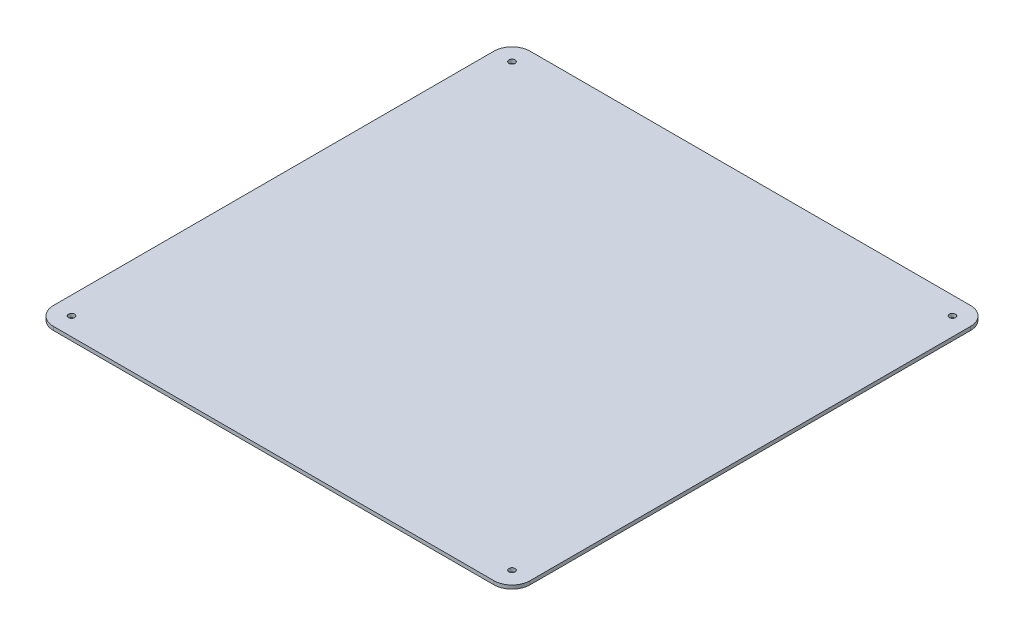
ISO-10303-21;
HEADER;
FILE_DESCRIPTION(('STEP AP214'),'2;1');
FILE_NAME('part.step','',(''),(''),'','','');
FILE_SCHEMA(('AUTOMOTIVE_DESIGN { 1 0 10303 214 1 1 1 1 }'));
ENDSEC;
DATA;
#1=APPLICATION_CONTEXT('core data for automotive mechanical design processes');
#2=APPLICATION_PROTOCOL_DEFINITION('international standard','automotive_design',2000,#1);
#3=PRODUCT_CONTEXT('',#1,'mechanical');
#4=PRODUCT('Part','Part','',(#3));
#5=PRODUCT_RELATED_PRODUCT_CATEGORY('part','',(#4));
#6=PRODUCT_DEFINITION_FORMATION('','',#4);
#7=PRODUCT_DEFINITION_CONTEXT('part definition',#1,'design');
#8=PRODUCT_DEFINITION('design','',#6,#7);
#9=PRODUCT_DEFINITION_SHAPE('','',#8);
#10=(LENGTH_UNIT() NAMED_UNIT(*) SI_UNIT(.MILLI.,.METRE.));
#11=(NAMED_UNIT(*) PLANE_ANGLE_UNIT() SI_UNIT($,.RADIAN.));
#12=(NAMED_UNIT(*) SI_UNIT($,.STERADIAN.) SOLID_ANGLE_UNIT());
#13=UNCERTAINTY_MEASURE_WITH_UNIT(LENGTH_MEASURE(1.E-05),#10,'distance_accuracy_value','');
#14=(GEOMETRIC_REPRESENTATION_CONTEXT(3) GLOBAL_UNCERTAINTY_ASSIGNED_CONTEXT((#13)) GLOBAL_UNIT_ASSIGNED_CONTEXT((#10,
#11,#12)) REPRESENTATION_CONTEXT('',''));
#15=CARTESIAN_POINT('',(0.,0.,0.));
#16=DIRECTION('',(0.,0.,1.));
#17=DIRECTION('',(1.,0.,0.));
#18=AXIS2_PLACEMENT_3D('',#15,#16,#17);
#19=CARTESIAN_POINT('',(0.,3.,0.));
#20=DIRECTION('',(0.,1.,0.));
#21=DIRECTION('',(0.,0.,1.));
#22=AXIS2_PLACEMENT_3D('',#19,#20,#21);
#23=PLANE('',#22);
#24=CARTESIAN_POINT('',(182.5,3.,182.5));
#25=DIRECTION('',(0.,1.,0.));
#26=DIRECTION('',(0.,0.,1.));
#27=AXIS2_PLACEMENT_3D('',#24,#25,#26);
#28=CIRCLE('',#27,2.54999999999999);
#29=CARTESIAN_POINT('',(182.5,3.,185.05));
#30=VERTEX_POINT('',#29);
#31=EDGE_CURVE('E358',#30,#30,#28,.T.);
#32=ORIENTED_EDGE('',*,*,#31,.F.);
#33=EDGE_LOOP('',(#32));
#34=FACE_BOUND('',#33,.T.);
#35=CARTESIAN_POINT('',(-182.5,3.,-182.5));
#36=DIRECTION('',(0.,1.,0.));
#37=DIRECTION('',(0.,0.,1.));
#38=AXIS2_PLACEMENT_3D('',#35,#36,#37);
#39=CIRCLE('',#38,2.54999999999999);
#40=CARTESIAN_POINT('',(-182.5,3.,-179.95));
#41=VERTEX_POINT('',#40);
#42=EDGE_CURVE('E165',#41,#41,#39,.T.);
#43=ORIENTED_EDGE('',*,*,#42,.F.);
#44=EDGE_LOOP('',(#43));
#45=FACE_BOUND('',#44,.T.);
#46=DIRECTION('',(-1.,0.,0.));
#47=VECTOR('',#46,1.);
#48=CARTESIAN_POINT('',(-197.5,3.,-197.5));
#49=LINE('',#48,#47);
#50=CARTESIAN_POINT('',(182.5,3.,-197.5));
#51=VERTEX_POINT('',#50);
#52=CARTESIAN_POINT('',(-182.5,3.,-197.5));
#53=VERTEX_POINT('',#52);
#54=EDGE_CURVE('E188',#51,#53,#49,.T.);
#55=ORIENTED_EDGE('',*,*,#54,.T.);
#56=CARTESIAN_POINT('',(-182.5,3.,-182.5));
#57=DIRECTION('',(0.,1.,0.));
#58=DIRECTION('',(0.,0.,1.));
#59=AXIS2_PLACEMENT_3D('',#56,#57,#58);
#60=CIRCLE('',#59,15.);
#61=CARTESIAN_POINT('',(-197.5,3.,-182.5));
#62=VERTEX_POINT('',#61);
#63=EDGE_CURVE('E196',#53,#62,#60,.T.);
#64=ORIENTED_EDGE('',*,*,#63,.T.);
#65=DIRECTION('',(0.,0.,1.));
#66=VECTOR('',#65,1.);
#67=CARTESIAN_POINT('',(-197.5,3.,-197.5));
#68=LINE('',#67,#66);
#69=CARTESIAN_POINT('',(-197.5,3.,182.5));
#70=VERTEX_POINT('',#69);
#71=EDGE_CURVE('E123',#62,#70,#68,.T.);
#72=ORIENTED_EDGE('',*,*,#71,.T.);
#73=CARTESIAN_POINT('',(-182.5,3.,182.5));
#74=DIRECTION('',(0.,1.,0.));
#75=DIRECTION('',(0.,0.,1.));
#76=AXIS2_PLACEMENT_3D('',#73,#74,#75);
#77=CIRCLE('',#76,15.);
#78=CARTESIAN_POINT('',(-182.5,3.,197.5));
#79=VERTEX_POINT('',#78);
#80=EDGE_CURVE('E59',#70,#79,#77,.T.);
#81=ORIENTED_EDGE('',*,*,#80,.T.);
#82=DIRECTION('',(1.,0.,0.));
#83=VECTOR('',#82,1.);
#84=CARTESIAN_POINT('',(-197.5,3.,197.5));
#85=LINE('',#84,#83);
#86=CARTESIAN_POINT('',(182.5,3.,197.5));
#87=VERTEX_POINT('',#86);
#88=EDGE_CURVE('E139',#79,#87,#85,.T.);
#89=ORIENTED_EDGE('',*,*,#88,.T.);
#90=CARTESIAN_POINT('',(182.5,3.,182.5));
#91=DIRECTION('',(0.,1.,0.));
#92=DIRECTION('',(0.,0.,1.));
#93=AXIS2_PLACEMENT_3D('',#90,#91,#92);
#94=CIRCLE('',#93,15.);
#95=CARTESIAN_POINT('',(197.5,3.,182.5));
#96=VERTEX_POINT('',#95);
#97=EDGE_CURVE('E150',#87,#96,#94,.T.);
#98=ORIENTED_EDGE('',*,*,#97,.T.);
#99=DIRECTION('',(0.,0.,-1.));
#100=VECTOR('',#99,1.);
#101=CARTESIAN_POINT('',(197.5,3.,-197.5));
#102=LINE('',#101,#100);
#103=CARTESIAN_POINT('',(197.5,3.,-182.5));
#104=VERTEX_POINT('',#103);
#105=EDGE_CURVE('E133',#96,#104,#102,.T.);
#106=ORIENTED_EDGE('',*,*,#105,.T.);
#107=CARTESIAN_POINT('',(182.5,3.,-182.5));
#108=DIRECTION('',(0.,1.,0.));
#109=DIRECTION('',(0.,0.,1.));
#110=AXIS2_PLACEMENT_3D('',#107,#108,#109);
#111=CIRCLE('',#110,15.);
#112=EDGE_CURVE('E194',#104,#51,#111,.T.);
#113=ORIENTED_EDGE('',*,*,#112,.T.);
#114=EDGE_LOOP('',(#55,#64,#72,#81,#89,#98,#106,#113));
#115=FACE_BOUND('',#114,.T.);
#116=CARTESIAN_POINT('',(182.5,3.,-182.5));
#117=DIRECTION('',(0.,1.,0.));
#118=DIRECTION('',(0.,0.,1.));
#119=AXIS2_PLACEMENT_3D('',#116,#117,#118);
#120=CIRCLE('',#119,2.54999999999999);
#121=CARTESIAN_POINT('',(182.5,3.,-179.95));
#122=VERTEX_POINT('',#121);
#123=EDGE_CURVE('E176',#122,#122,#120,.T.);
#124=ORIENTED_EDGE('',*,*,#123,.F.);
#125=EDGE_LOOP('',(#124));
#126=FACE_BOUND('',#125,.T.);
#127=CARTESIAN_POINT('',(-182.5,3.,182.5));
#128=DIRECTION('',(0.,1.,0.));
#129=DIRECTION('',(0.,0.,1.));
#130=AXIS2_PLACEMENT_3D('',#127,#128,#129);
#131=CIRCLE('',#130,2.54999999999999);
#132=CARTESIAN_POINT('',(-182.5,3.,185.05));
#133=VERTEX_POINT('',#132);
#134=EDGE_CURVE('E354',#133,#133,#131,.T.);
#135=ORIENTED_EDGE('',*,*,#134,.F.);
#136=EDGE_LOOP('',(#135));
#137=FACE_BOUND('',#136,.T.);
#138=ADVANCED_FACE('F39',(#34,#45,#115,#126,#137),#23,.T.);
#139=CARTESIAN_POINT('',(0.,0.,0.));
#140=DIRECTION('',(0.,1.,0.));
#141=DIRECTION('',(0.,0.,1.));
#142=AXIS2_PLACEMENT_3D('',#139,#140,#141);
#143=PLANE('',#142);
#144=DIRECTION('',(0.,0.,1.));
#145=VECTOR('',#144,1.);
#146=CARTESIAN_POINT('',(-197.5,0.,-197.5));
#147=LINE('',#146,#145);
#148=CARTESIAN_POINT('',(-197.5,0.,-182.5));
#149=VERTEX_POINT('',#148);
#150=CARTESIAN_POINT('',(-197.5,0.,182.5));
#151=VERTEX_POINT('',#150);
#152=EDGE_CURVE('E121',#149,#151,#147,.T.);
#153=ORIENTED_EDGE('',*,*,#152,.F.);
#154=CARTESIAN_POINT('',(-182.5,0.,-182.5));
#155=DIRECTION('',(0.,1.,0.));
#156=DIRECTION('',(0.,0.,1.));
#157=AXIS2_PLACEMENT_3D('',#154,#155,#156);
#158=CIRCLE('',#157,15.);
#159=CARTESIAN_POINT('',(-182.5,0.,-197.5));
#160=VERTEX_POINT('',#159);
#161=EDGE_CURVE('E104',#149,#160,#158,.F.);
#162=ORIENTED_EDGE('',*,*,#161,.T.);
#163=DIRECTION('',(-1.,0.,0.));
#164=VECTOR('',#163,1.);
#165=CARTESIAN_POINT('',(-197.5,0.,-197.5));
#166=LINE('',#165,#164);
#167=CARTESIAN_POINT('',(182.5,0.,-197.5));
#168=VERTEX_POINT('',#167);
#169=EDGE_CURVE('E131',#168,#160,#166,.T.);
#170=ORIENTED_EDGE('',*,*,#169,.F.);
#171=CARTESIAN_POINT('',(182.5,0.,-182.5));
#172=DIRECTION('',(0.,1.,0.));
#173=DIRECTION('',(0.,0.,1.));
#174=AXIS2_PLACEMENT_3D('',#171,#172,#173);
#175=CIRCLE('',#174,15.);
#176=CARTESIAN_POINT('',(197.5,0.,-182.5));
#177=VERTEX_POINT('',#176);
#178=EDGE_CURVE('E115',#168,#177,#175,.F.);
#179=ORIENTED_EDGE('',*,*,#178,.T.);
#180=DIRECTION('',(0.,0.,-1.));
#181=VECTOR('',#180,1.);
#182=CARTESIAN_POINT('',(197.5,0.,-197.5));
#183=LINE('',#182,#181);
#184=CARTESIAN_POINT('',(197.5,0.,182.5));
#185=VERTEX_POINT('',#184);
#186=EDGE_CURVE('E135',#185,#177,#183,.T.);
#187=ORIENTED_EDGE('',*,*,#186,.F.);
#188=CARTESIAN_POINT('',(182.5,0.,182.5));
#189=DIRECTION('',(0.,1.,0.));
#190=DIRECTION('',(0.,0.,1.));
#191=AXIS2_PLACEMENT_3D('',#188,#189,#190);
#192=CIRCLE('',#191,15.);
#193=CARTESIAN_POINT('',(182.5,0.,197.5));
#194=VERTEX_POINT('',#193);
#195=EDGE_CURVE('E142',#185,#194,#192,.F.);
#196=ORIENTED_EDGE('',*,*,#195,.T.);
#197=DIRECTION('',(1.,0.,0.));
#198=VECTOR('',#197,1.);
#199=CARTESIAN_POINT('',(-197.5,0.,197.5));
#200=LINE('',#199,#198);
#201=CARTESIAN_POINT('',(-182.5,0.,197.5));
#202=VERTEX_POINT('',#201);
#203=EDGE_CURVE('E130',#202,#194,#200,.T.);
#204=ORIENTED_EDGE('',*,*,#203,.F.);
#205=CARTESIAN_POINT('',(-182.5,0.,182.5));
#206=DIRECTION('',(0.,1.,0.));
#207=DIRECTION('',(0.,0.,1.));
#208=AXIS2_PLACEMENT_3D('',#205,#206,#207);
#209=CIRCLE('',#208,15.);
#210=EDGE_CURVE('E124',#202,#151,#209,.F.);
#211=ORIENTED_EDGE('',*,*,#210,.T.);
#212=EDGE_LOOP('',(#153,#162,#170,#179,#187,#196,#204,#211));
#213=FACE_BOUND('',#212,.T.);
#214=CARTESIAN_POINT('',(-182.5,0.,-182.5));
#215=DIRECTION('',(0.,1.,0.));
#216=DIRECTION('',(0.,0.,1.));
#217=AXIS2_PLACEMENT_3D('',#214,#215,#216);
#218=CIRCLE('',#217,2.54999999999999);
#219=CARTESIAN_POINT('',(-182.5,0.,-179.95));
#220=VERTEX_POINT('',#219);
#221=EDGE_CURVE('E171',#220,#220,#218,.T.);
#222=ORIENTED_EDGE('',*,*,#221,.T.);
#223=EDGE_LOOP('',(#222));
#224=FACE_BOUND('',#223,.T.);
#225=CARTESIAN_POINT('',(182.5,0.,-182.5));
#226=DIRECTION('',(0.,1.,0.));
#227=DIRECTION('',(0.,0.,1.));
#228=AXIS2_PLACEMENT_3D('',#225,#226,#227);
#229=CIRCLE('',#228,2.54999999999999);
#230=CARTESIAN_POINT('',(182.5,0.,-179.95));
#231=VERTEX_POINT('',#230);
#232=EDGE_CURVE('E180',#231,#231,#229,.T.);
#233=ORIENTED_EDGE('',*,*,#232,.T.);
#234=EDGE_LOOP('',(#233));
#235=FACE_BOUND('',#234,.T.);
#236=CARTESIAN_POINT('',(182.5,0.,182.5));
#237=DIRECTION('',(0.,1.,0.));
#238=DIRECTION('',(0.,0.,1.));
#239=AXIS2_PLACEMENT_3D('',#236,#237,#238);
#240=CIRCLE('',#239,2.54999999999999);
#241=CARTESIAN_POINT('',(182.5,0.,185.05));
#242=VERTEX_POINT('',#241);
#243=EDGE_CURVE('E349',#242,#242,#240,.T.);
#244=ORIENTED_EDGE('',*,*,#243,.T.);
#245=EDGE_LOOP('',(#244));
#246=FACE_BOUND('',#245,.T.);
#247=CARTESIAN_POINT('',(-182.5,0.,182.5));
#248=DIRECTION('',(0.,1.,0.));
#249=DIRECTION('',(0.,0.,1.));
#250=AXIS2_PLACEMENT_3D('',#247,#248,#249);
#251=CIRCLE('',#250,2.54999999999999);
#252=CARTESIAN_POINT('',(-182.5,0.,185.05));
#253=VERTEX_POINT('',#252);
#254=EDGE_CURVE('E352',#253,#253,#251,.T.);
#255=ORIENTED_EDGE('',*,*,#254,.T.);
#256=EDGE_LOOP('',(#255));
#257=FACE_BOUND('',#256,.T.);
#258=ADVANCED_FACE('F127',(#213,#224,#235,#246,#257),#143,.F.);
#259=CARTESIAN_POINT('',(197.5,3.,-197.5));
#260=DIRECTION('',(-1.,0.,0.));
#261=DIRECTION('',(0.,0.,1.));
#262=AXIS2_PLACEMENT_3D('',#259,#260,#261);
#263=PLANE('',#262);
#264=ORIENTED_EDGE('',*,*,#186,.T.);
#265=DIRECTION('',(0.,-1.,0.));
#266=VECTOR('',#265,1.);
#267=CARTESIAN_POINT('',(197.5,3.,-182.5));
#268=LINE('',#267,#266);
#269=EDGE_CURVE('E201',#177,#104,#268,.F.);
#270=ORIENTED_EDGE('',*,*,#269,.T.);
#271=ORIENTED_EDGE('',*,*,#105,.F.);
#272=DIRECTION('',(0.,-1.,0.));
#273=VECTOR('',#272,1.);
#274=CARTESIAN_POINT('',(197.5,3.,182.5));
#275=LINE('',#274,#273);
#276=EDGE_CURVE('E199',#96,#185,#275,.T.);
#277=ORIENTED_EDGE('',*,*,#276,.T.);
#278=EDGE_LOOP('',(#264,#270,#271,#277));
#279=FACE_BOUND('',#278,.T.);
#280=ADVANCED_FACE('F211',(#279),#263,.F.);
#281=CARTESIAN_POINT('',(-197.5,3.,-197.5));
#282=DIRECTION('',(0.,0.,1.));
#283=DIRECTION('',(1.,0.,0.));
#284=AXIS2_PLACEMENT_3D('',#281,#282,#283);
#285=PLANE('',#284);
#286=ORIENTED_EDGE('',*,*,#169,.T.);
#287=DIRECTION('',(0.,-1.,0.));
#288=VECTOR('',#287,1.);
#289=CARTESIAN_POINT('',(-182.5,3.,-197.5));
#290=LINE('',#289,#288);
#291=EDGE_CURVE('E109',#160,#53,#290,.F.);
#292=ORIENTED_EDGE('',*,*,#291,.T.);
#293=ORIENTED_EDGE('',*,*,#54,.F.);
#294=DIRECTION('',(0.,-1.,0.));
#295=VECTOR('',#294,1.);
#296=CARTESIAN_POINT('',(182.5,3.,-197.5));
#297=LINE('',#296,#295);
#298=EDGE_CURVE('E114',#51,#168,#297,.T.);
#299=ORIENTED_EDGE('',*,*,#298,.T.);
#300=EDGE_LOOP('',(#286,#292,#293,#299));
#301=FACE_BOUND('',#300,.T.);
#302=ADVANCED_FACE('F219',(#301),#285,.F.);
#303=CARTESIAN_POINT('',(-197.5,3.,-197.5));
#304=DIRECTION('',(1.,0.,0.));
#305=DIRECTION('',(0.,0.,-1.));
#306=AXIS2_PLACEMENT_3D('',#303,#304,#305);
#307=PLANE('',#306);
#308=ORIENTED_EDGE('',*,*,#71,.F.);
#309=DIRECTION('',(0.,-1.,0.));
#310=VECTOR('',#309,1.);
#311=CARTESIAN_POINT('',(-197.5,3.,-182.5));
#312=LINE('',#311,#310);
#313=EDGE_CURVE('E108',#62,#149,#312,.T.);
#314=ORIENTED_EDGE('',*,*,#313,.T.);
#315=ORIENTED_EDGE('',*,*,#152,.T.);
#316=DIRECTION('',(0.,-1.,0.));
#317=VECTOR('',#316,1.);
#318=CARTESIAN_POINT('',(-197.5,3.,182.5));
#319=LINE('',#318,#317);
#320=EDGE_CURVE('E125',#151,#70,#319,.F.);
#321=ORIENTED_EDGE('',*,*,#320,.T.);
#322=EDGE_LOOP('',(#308,#314,#315,#321));
#323=FACE_BOUND('',#322,.T.);
#324=ADVANCED_FACE('F120',(#323),#307,.F.);
#325=CARTESIAN_POINT('',(-197.5,3.,197.5));
#326=DIRECTION('',(0.,0.,-1.));
#327=DIRECTION('',(-1.,0.,0.));
#328=AXIS2_PLACEMENT_3D('',#325,#326,#327);
#329=PLANE('',#328);
#330=ORIENTED_EDGE('',*,*,#203,.T.);
#331=DIRECTION('',(0.,-1.,0.));
#332=VECTOR('',#331,1.);
#333=CARTESIAN_POINT('',(182.5,3.,197.5));
#334=LINE('',#333,#332);
#335=EDGE_CURVE('E12',#194,#87,#334,.F.);
#336=ORIENTED_EDGE('',*,*,#335,.T.);
#337=ORIENTED_EDGE('',*,*,#88,.F.);
#338=DIRECTION('',(0.,-1.,0.));
#339=VECTOR('',#338,1.);
#340=CARTESIAN_POINT('',(-182.5,3.,197.5));
#341=LINE('',#340,#339);
#342=EDGE_CURVE('E47',#79,#202,#341,.T.);
#343=ORIENTED_EDGE('',*,*,#342,.T.);
#344=EDGE_LOOP('',(#330,#336,#337,#343));
#345=FACE_BOUND('',#344,.T.);
#346=ADVANCED_FACE('F204',(#345),#329,.F.);
#347=CARTESIAN_POINT('',(-182.5,3.,-182.5));
#348=DIRECTION('',(0.,-1.,0.));
#349=DIRECTION('',(0.,0.,-1.));
#350=AXIS2_PLACEMENT_3D('',#347,#348,#349);
#351=CYLINDRICAL_SURFACE('',#350,2.54999999999999);
#352=ORIENTED_EDGE('',*,*,#42,.T.);
#353=EDGE_LOOP('',(#352));
#354=FACE_BOUND('',#353,.T.);
#355=ORIENTED_EDGE('',*,*,#221,.F.);
#356=EDGE_LOOP('',(#355));
#357=FACE_BOUND('',#356,.T.);
#358=ADVANCED_FACE('F234',(#354,#357),#351,.F.);
#359=CARTESIAN_POINT('',(182.5,3.,-182.5));
#360=DIRECTION('',(0.,-1.,0.));
#361=DIRECTION('',(0.,0.,-1.));
#362=AXIS2_PLACEMENT_3D('',#359,#360,#361);
#363=CYLINDRICAL_SURFACE('',#362,2.54999999999999);
#364=ORIENTED_EDGE('',*,*,#123,.T.);
#365=EDGE_LOOP('',(#364));
#366=FACE_BOUND('',#365,.T.);
#367=ORIENTED_EDGE('',*,*,#232,.F.);
#368=EDGE_LOOP('',(#367));
#369=FACE_BOUND('',#368,.T.);
#370=ADVANCED_FACE('F287',(#366,#369),#363,.F.);
#371=CARTESIAN_POINT('',(182.5,3.,182.5));
#372=DIRECTION('',(0.,-1.,0.));
#373=DIRECTION('',(0.,0.,-1.));
#374=AXIS2_PLACEMENT_3D('',#371,#372,#373);
#375=CYLINDRICAL_SURFACE('',#374,2.54999999999999);
#376=ORIENTED_EDGE('',*,*,#31,.T.);
#377=EDGE_LOOP('',(#376));
#378=FACE_BOUND('',#377,.T.);
#379=ORIENTED_EDGE('',*,*,#243,.F.);
#380=EDGE_LOOP('',(#379));
#381=FACE_BOUND('',#380,.T.);
#382=ADVANCED_FACE('F278',(#378,#381),#375,.F.);
#383=CARTESIAN_POINT('',(-182.5,3.,182.5));
#384=DIRECTION('',(0.,-1.,0.));
#385=DIRECTION('',(0.,0.,-1.));
#386=AXIS2_PLACEMENT_3D('',#383,#384,#385);
#387=CYLINDRICAL_SURFACE('',#386,2.54999999999999);
#388=ORIENTED_EDGE('',*,*,#134,.T.);
#389=EDGE_LOOP('',(#388));
#390=FACE_BOUND('',#389,.T.);
#391=ORIENTED_EDGE('',*,*,#254,.F.);
#392=EDGE_LOOP('',(#391));
#393=FACE_BOUND('',#392,.T.);
#394=ADVANCED_FACE('F247',(#390,#393),#387,.F.);
#395=CARTESIAN_POINT('',(-182.5,3.,-182.5));
#396=DIRECTION('',(0.,-1.,0.));
#397=DIRECTION('',(0.,0.,-1.));
#398=AXIS2_PLACEMENT_3D('',#395,#396,#397);
#399=CYLINDRICAL_SURFACE('',#398,15.);
#400=ORIENTED_EDGE('',*,*,#63,.F.);
#401=ORIENTED_EDGE('',*,*,#291,.F.);
#402=ORIENTED_EDGE('',*,*,#161,.F.);
#403=ORIENTED_EDGE('',*,*,#313,.F.);
#404=EDGE_LOOP('',(#400,#401,#402,#403));
#405=FACE_BOUND('',#404,.T.);
#406=ADVANCED_FACE('F107',(#405),#399,.T.);
#407=CARTESIAN_POINT('',(182.5,3.,-182.5));
#408=DIRECTION('',(0.,-1.,0.));
#409=DIRECTION('',(0.,0.,-1.));
#410=AXIS2_PLACEMENT_3D('',#407,#408,#409);
#411=CYLINDRICAL_SURFACE('',#410,15.);
#412=ORIENTED_EDGE('',*,*,#112,.F.);
#413=ORIENTED_EDGE('',*,*,#269,.F.);
#414=ORIENTED_EDGE('',*,*,#178,.F.);
#415=ORIENTED_EDGE('',*,*,#298,.F.);
#416=EDGE_LOOP('',(#412,#413,#414,#415));
#417=FACE_BOUND('',#416,.T.);
#418=ADVANCED_FACE('F217',(#417),#411,.T.);
#419=CARTESIAN_POINT('',(182.5,3.,182.5));
#420=DIRECTION('',(0.,-1.,0.));
#421=DIRECTION('',(0.,0.,-1.));
#422=AXIS2_PLACEMENT_3D('',#419,#420,#421);
#423=CYLINDRICAL_SURFACE('',#422,15.);
#424=ORIENTED_EDGE('',*,*,#97,.F.);
#425=ORIENTED_EDGE('',*,*,#335,.F.);
#426=ORIENTED_EDGE('',*,*,#195,.F.);
#427=ORIENTED_EDGE('',*,*,#276,.F.);
#428=EDGE_LOOP('',(#424,#425,#426,#427));
#429=FACE_BOUND('',#428,.T.);
#430=ADVANCED_FACE('F209',(#429),#423,.T.);
#431=CARTESIAN_POINT('',(-182.5,3.,182.5));
#432=DIRECTION('',(0.,-1.,0.));
#433=DIRECTION('',(0.,0.,-1.));
#434=AXIS2_PLACEMENT_3D('',#431,#432,#433);
#435=CYLINDRICAL_SURFACE('',#434,15.);
#436=ORIENTED_EDGE('',*,*,#80,.F.);
#437=ORIENTED_EDGE('',*,*,#320,.F.);
#438=ORIENTED_EDGE('',*,*,#210,.F.);
#439=ORIENTED_EDGE('',*,*,#342,.F.);
#440=EDGE_LOOP('',(#436,#437,#438,#439));
#441=FACE_BOUND('',#440,.T.);
#442=ADVANCED_FACE('F41',(#441),#435,.T.);
#443=CLOSED_SHELL('',(#138,#258,#280,#302,#324,#346,#358,#370,#382,#394,#406,#418,#430,#442));
#444=MANIFOLD_SOLID_BREP('B2',#443);
#445=ADVANCED_BREP_SHAPE_REPRESENTATION('',(#18,#444),#14);
#446=SHAPE_DEFINITION_REPRESENTATION(#9,#445);
ENDSEC;
END-ISO-10303-21;
